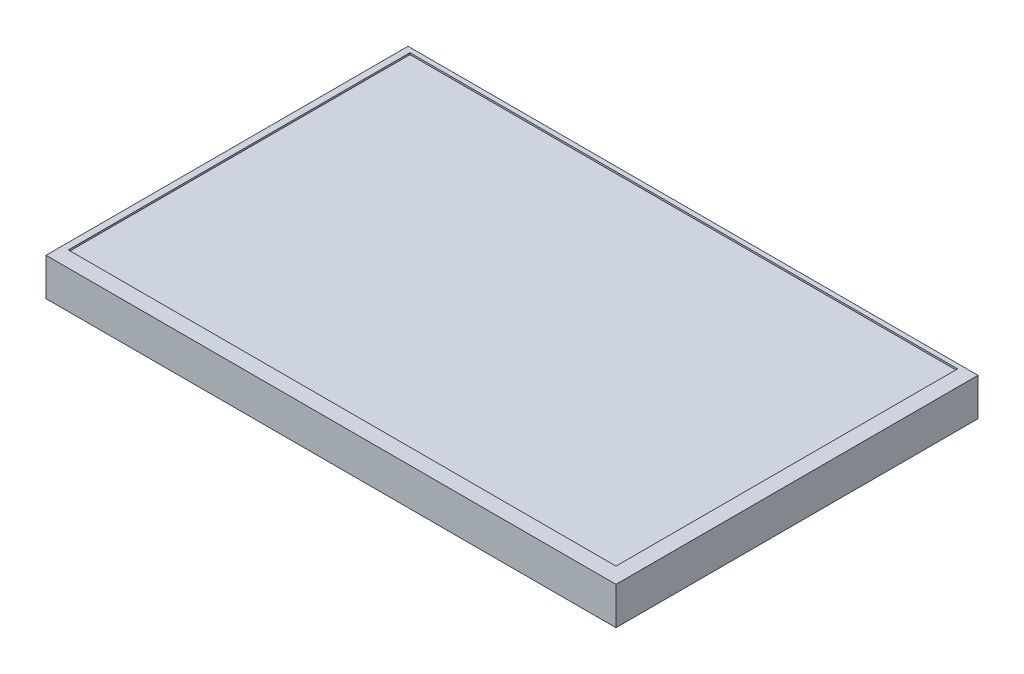
ISO-10303-21;
HEADER;
FILE_DESCRIPTION(('STEP AP214'),'2;1');
FILE_NAME('part.step','',(''),(''),'','','');
FILE_SCHEMA(('AUTOMOTIVE_DESIGN { 1 0 10303 214 1 1 1 1 }'));
ENDSEC;
DATA;
#1=APPLICATION_CONTEXT('core data for automotive mechanical design processes');
#2=APPLICATION_PROTOCOL_DEFINITION('international standard','automotive_design',2000,#1);
#3=PRODUCT_CONTEXT('',#1,'mechanical');
#4=PRODUCT('Part','Part','',(#3));
#5=PRODUCT_RELATED_PRODUCT_CATEGORY('part','',(#4));
#6=PRODUCT_DEFINITION_FORMATION('','',#4);
#7=PRODUCT_DEFINITION_CONTEXT('part definition',#1,'design');
#8=PRODUCT_DEFINITION('design','',#6,#7);
#9=PRODUCT_DEFINITION_SHAPE('','',#8);
#10=(LENGTH_UNIT() NAMED_UNIT(*) SI_UNIT(.MILLI.,.METRE.));
#11=(NAMED_UNIT(*) PLANE_ANGLE_UNIT() SI_UNIT($,.RADIAN.));
#12=(NAMED_UNIT(*) SI_UNIT($,.STERADIAN.) SOLID_ANGLE_UNIT());
#13=UNCERTAINTY_MEASURE_WITH_UNIT(LENGTH_MEASURE(1.E-05),#10,'distance_accuracy_value','');
#14=(GEOMETRIC_REPRESENTATION_CONTEXT(3) GLOBAL_UNCERTAINTY_ASSIGNED_CONTEXT((#13)) GLOBAL_UNIT_ASSIGNED_CONTEXT((#10,
#11,#12)) REPRESENTATION_CONTEXT('',''));
#15=CARTESIAN_POINT('',(0.,0.,0.));
#16=DIRECTION('',(0.,0.,1.));
#17=DIRECTION('',(1.,0.,0.));
#18=AXIS2_PLACEMENT_3D('',#15,#16,#17);
#19=CARTESIAN_POINT('',(83.,10.95,-52.72));
#20=DIRECTION('',(-1.,0.,0.));
#21=DIRECTION('',(0.,0.,1.));
#22=AXIS2_PLACEMENT_3D('',#19,#20,#21);
#23=PLANE('',#22);
#24=DIRECTION('',(0.,0.,-1.));
#25=VECTOR('',#24,1.);
#26=CARTESIAN_POINT('',(83.,0.,-52.72));
#27=LINE('',#26,#25);
#28=CARTESIAN_POINT('',(83.,0.,52.72));
#29=VERTEX_POINT('',#28);
#30=CARTESIAN_POINT('',(83.,0.,-52.72));
#31=VERTEX_POINT('',#30);
#32=EDGE_CURVE('E142',#29,#31,#27,.T.);
#33=ORIENTED_EDGE('',*,*,#32,.T.);
#34=DIRECTION('',(0.,-1.,0.));
#35=VECTOR('',#34,1.);
#36=CARTESIAN_POINT('',(83.,10.95,-52.72));
#37=LINE('',#36,#35);
#38=CARTESIAN_POINT('',(83.,10.95,-52.72));
#39=VERTEX_POINT('',#38);
#40=EDGE_CURVE('E11',#39,#31,#37,.T.);
#41=ORIENTED_EDGE('',*,*,#40,.F.);
#42=DIRECTION('',(0.,0.,-1.));
#43=VECTOR('',#42,1.);
#44=CARTESIAN_POINT('',(83.,10.95,-52.72));
#45=LINE('',#44,#43);
#46=CARTESIAN_POINT('',(83.,10.95,52.72));
#47=VERTEX_POINT('',#46);
#48=EDGE_CURVE('E146',#47,#39,#45,.T.);
#49=ORIENTED_EDGE('',*,*,#48,.F.);
#50=DIRECTION('',(0.,-1.,0.));
#51=VECTOR('',#50,1.);
#52=CARTESIAN_POINT('',(83.,10.95,52.72));
#53=LINE('',#52,#51);
#54=EDGE_CURVE('E152',#47,#29,#53,.T.);
#55=ORIENTED_EDGE('',*,*,#54,.T.);
#56=EDGE_LOOP('',(#33,#41,#49,#55));
#57=FACE_BOUND('',#56,.T.);
#58=ADVANCED_FACE('F34',(#57),#23,.F.);
#59=CARTESIAN_POINT('',(-83.,10.95,-52.72));
#60=DIRECTION('',(0.,0.,1.));
#61=DIRECTION('',(1.,0.,0.));
#62=AXIS2_PLACEMENT_3D('',#59,#60,#61);
#63=PLANE('',#62);
#64=DIRECTION('',(-1.,0.,0.));
#65=VECTOR('',#64,1.);
#66=CARTESIAN_POINT('',(-83.,0.,-52.72));
#67=LINE('',#66,#65);
#68=CARTESIAN_POINT('',(-83.,0.,-52.72));
#69=VERTEX_POINT('',#68);
#70=EDGE_CURVE('E155',#31,#69,#67,.T.);
#71=ORIENTED_EDGE('',*,*,#70,.T.);
#72=DIRECTION('',(0.,-1.,0.));
#73=VECTOR('',#72,1.);
#74=CARTESIAN_POINT('',(-83.,10.95,-52.72));
#75=LINE('',#74,#73);
#76=CARTESIAN_POINT('',(-83.,10.95,-52.72));
#77=VERTEX_POINT('',#76);
#78=EDGE_CURVE('E41',#77,#69,#75,.T.);
#79=ORIENTED_EDGE('',*,*,#78,.F.);
#80=DIRECTION('',(-1.,0.,0.));
#81=VECTOR('',#80,1.);
#82=CARTESIAN_POINT('',(-83.,10.95,-52.72));
#83=LINE('',#82,#81);
#84=EDGE_CURVE('E85',#39,#77,#83,.T.);
#85=ORIENTED_EDGE('',*,*,#84,.F.);
#86=ORIENTED_EDGE('',*,*,#40,.T.);
#87=EDGE_LOOP('',(#71,#79,#85,#86));
#88=FACE_BOUND('',#87,.T.);
#89=ADVANCED_FACE('F184',(#88),#63,.F.);
#90=CARTESIAN_POINT('',(-83.,10.95,-52.72));
#91=DIRECTION('',(1.,0.,0.));
#92=DIRECTION('',(0.,0.,-1.));
#93=AXIS2_PLACEMENT_3D('',#90,#91,#92);
#94=PLANE('',#93);
#95=DIRECTION('',(0.,0.,1.));
#96=VECTOR('',#95,1.);
#97=CARTESIAN_POINT('',(-83.,0.,-52.72));
#98=LINE('',#97,#96);
#99=CARTESIAN_POINT('',(-83.,0.,52.72));
#100=VERTEX_POINT('',#99);
#101=EDGE_CURVE('E157',#69,#100,#98,.T.);
#102=ORIENTED_EDGE('',*,*,#101,.T.);
#103=DIRECTION('',(0.,-1.,0.));
#104=VECTOR('',#103,1.);
#105=CARTESIAN_POINT('',(-83.,10.95,52.72));
#106=LINE('',#105,#104);
#107=CARTESIAN_POINT('',(-83.,10.95,52.72));
#108=VERTEX_POINT('',#107);
#109=EDGE_CURVE('E161',#108,#100,#106,.T.);
#110=ORIENTED_EDGE('',*,*,#109,.F.);
#111=DIRECTION('',(0.,0.,1.));
#112=VECTOR('',#111,1.);
#113=CARTESIAN_POINT('',(-83.,10.95,-52.72));
#114=LINE('',#113,#112);
#115=EDGE_CURVE('E149',#77,#108,#114,.T.);
#116=ORIENTED_EDGE('',*,*,#115,.F.);
#117=ORIENTED_EDGE('',*,*,#78,.T.);
#118=EDGE_LOOP('',(#102,#110,#116,#117));
#119=FACE_BOUND('',#118,.T.);
#120=ADVANCED_FACE('F166',(#119),#94,.F.);
#121=CARTESIAN_POINT('',(-83.,10.95,52.72));
#122=DIRECTION('',(0.,0.,-1.));
#123=DIRECTION('',(-1.,0.,0.));
#124=AXIS2_PLACEMENT_3D('',#121,#122,#123);
#125=PLANE('',#124);
#126=DIRECTION('',(1.,0.,0.));
#127=VECTOR('',#126,1.);
#128=CARTESIAN_POINT('',(-83.,0.,52.72));
#129=LINE('',#128,#127);
#130=EDGE_CURVE('E78',#100,#29,#129,.T.);
#131=ORIENTED_EDGE('',*,*,#130,.T.);
#132=ORIENTED_EDGE('',*,*,#54,.F.);
#133=DIRECTION('',(1.,0.,0.));
#134=VECTOR('',#133,1.);
#135=CARTESIAN_POINT('',(-83.,10.95,52.72));
#136=LINE('',#135,#134);
#137=EDGE_CURVE('E57',#108,#47,#136,.T.);
#138=ORIENTED_EDGE('',*,*,#137,.F.);
#139=ORIENTED_EDGE('',*,*,#109,.T.);
#140=EDGE_LOOP('',(#131,#132,#138,#139));
#141=FACE_BOUND('',#140,.T.);
#142=ADVANCED_FACE('F174',(#141),#125,.F.);
#143=CARTESIAN_POINT('',(0.,10.95,0.));
#144=DIRECTION('',(0.,1.,0.));
#145=DIRECTION('',(0.,0.,1.));
#146=AXIS2_PLACEMENT_3D('',#143,#144,#145);
#147=PLANE('',#146);
#148=DIRECTION('',(0.,0.,1.));
#149=VECTOR('',#148,1.);
#150=CARTESIAN_POINT('',(-81.1,10.95,-51.37));
#151=LINE('',#150,#149);
#152=CARTESIAN_POINT('',(-81.1,10.95,-51.37));
#153=VERTEX_POINT('',#152);
#154=CARTESIAN_POINT('',(-81.1,10.95,48.12));
#155=VERTEX_POINT('',#154);
#156=EDGE_CURVE('E48',#153,#155,#151,.T.);
#157=ORIENTED_EDGE('',*,*,#156,.F.);
#158=DIRECTION('',(-1.,0.,0.));
#159=VECTOR('',#158,1.);
#160=CARTESIAN_POINT('',(-81.1,10.95,-51.37));
#161=LINE('',#160,#159);
#162=CARTESIAN_POINT('',(78.4,10.95,-51.37));
#163=VERTEX_POINT('',#162);
#164=EDGE_CURVE('E127',#163,#153,#161,.T.);
#165=ORIENTED_EDGE('',*,*,#164,.F.);
#166=DIRECTION('',(0.,0.,-1.));
#167=VECTOR('',#166,1.);
#168=CARTESIAN_POINT('',(78.4,10.95,-51.37));
#169=LINE('',#168,#167);
#170=CARTESIAN_POINT('',(78.4,10.95,48.12));
#171=VERTEX_POINT('',#170);
#172=EDGE_CURVE('E130',#171,#163,#169,.T.);
#173=ORIENTED_EDGE('',*,*,#172,.F.);
#174=DIRECTION('',(1.,0.,0.));
#175=VECTOR('',#174,1.);
#176=CARTESIAN_POINT('',(-81.1,10.95,48.12));
#177=LINE('',#176,#175);
#178=EDGE_CURVE('E136',#155,#171,#177,.T.);
#179=ORIENTED_EDGE('',*,*,#178,.F.);
#180=EDGE_LOOP('',(#157,#165,#173,#179));
#181=FACE_BOUND('',#180,.T.);
#182=ORIENTED_EDGE('',*,*,#48,.T.);
#183=ORIENTED_EDGE('',*,*,#84,.T.);
#184=ORIENTED_EDGE('',*,*,#115,.T.);
#185=ORIENTED_EDGE('',*,*,#137,.T.);
#186=EDGE_LOOP('',(#182,#183,#184,#185));
#187=FACE_BOUND('',#186,.T.);
#188=ADVANCED_FACE('F176',(#181,#187),#147,.T.);
#189=CARTESIAN_POINT('',(0.,0.,0.));
#190=DIRECTION('',(0.,1.,0.));
#191=DIRECTION('',(0.,0.,1.));
#192=AXIS2_PLACEMENT_3D('',#189,#190,#191);
#193=PLANE('',#192);
#194=ORIENTED_EDGE('',*,*,#32,.F.);
#195=ORIENTED_EDGE('',*,*,#130,.F.);
#196=ORIENTED_EDGE('',*,*,#101,.F.);
#197=ORIENTED_EDGE('',*,*,#70,.F.);
#198=EDGE_LOOP('',(#194,#195,#196,#197));
#199=FACE_BOUND('',#198,.T.);
#200=ADVANCED_FACE('F170',(#199),#193,.F.);
#201=CARTESIAN_POINT('',(-81.1,10.45,-51.37));
#202=DIRECTION('',(-1.,0.,0.));
#203=DIRECTION('',(0.,0.,1.));
#204=AXIS2_PLACEMENT_3D('',#201,#202,#203);
#205=PLANE('',#204);
#206=ORIENTED_EDGE('',*,*,#156,.T.);
#207=DIRECTION('',(0.,1.,0.));
#208=VECTOR('',#207,1.);
#209=CARTESIAN_POINT('',(-81.1,10.45,48.12));
#210=LINE('',#209,#208);
#211=CARTESIAN_POINT('',(-81.1,10.45,48.12));
#212=VERTEX_POINT('',#211);
#213=EDGE_CURVE('E105',#212,#155,#210,.T.);
#214=ORIENTED_EDGE('',*,*,#213,.F.);
#215=DIRECTION('',(0.,0.,1.));
#216=VECTOR('',#215,1.);
#217=CARTESIAN_POINT('',(-81.1,10.45,-51.37));
#218=LINE('',#217,#216);
#219=CARTESIAN_POINT('',(-81.1,10.45,-51.37));
#220=VERTEX_POINT('',#219);
#221=EDGE_CURVE('E109',#220,#212,#218,.T.);
#222=ORIENTED_EDGE('',*,*,#221,.F.);
#223=DIRECTION('',(0.,1.,0.));
#224=VECTOR('',#223,1.);
#225=CARTESIAN_POINT('',(-81.1,10.45,-51.37));
#226=LINE('',#225,#224);
#227=EDGE_CURVE('E140',#220,#153,#226,.T.);
#228=ORIENTED_EDGE('',*,*,#227,.T.);
#229=EDGE_LOOP('',(#206,#214,#222,#228));
#230=FACE_BOUND('',#229,.T.);
#231=ADVANCED_FACE('F107',(#230),#205,.F.);
#232=CARTESIAN_POINT('',(-81.1,10.45,-51.37));
#233=DIRECTION('',(0.,0.,-1.));
#234=DIRECTION('',(-1.,0.,0.));
#235=AXIS2_PLACEMENT_3D('',#232,#233,#234);
#236=PLANE('',#235);
#237=ORIENTED_EDGE('',*,*,#164,.T.);
#238=ORIENTED_EDGE('',*,*,#227,.F.);
#239=DIRECTION('',(-1.,0.,0.));
#240=VECTOR('',#239,1.);
#241=CARTESIAN_POINT('',(-81.1,10.45,-51.37));
#242=LINE('',#241,#240);
#243=CARTESIAN_POINT('',(78.4,10.45,-51.37));
#244=VERTEX_POINT('',#243);
#245=EDGE_CURVE('E115',#244,#220,#242,.T.);
#246=ORIENTED_EDGE('',*,*,#245,.F.);
#247=DIRECTION('',(0.,1.,0.));
#248=VECTOR('',#247,1.);
#249=CARTESIAN_POINT('',(78.4,10.45,-51.37));
#250=LINE('',#249,#248);
#251=EDGE_CURVE('E143',#244,#163,#250,.T.);
#252=ORIENTED_EDGE('',*,*,#251,.T.);
#253=EDGE_LOOP('',(#237,#238,#246,#252));
#254=FACE_BOUND('',#253,.T.);
#255=ADVANCED_FACE('F238',(#254),#236,.F.);
#256=CARTESIAN_POINT('',(78.4,10.45,-51.37));
#257=DIRECTION('',(1.,0.,0.));
#258=DIRECTION('',(0.,0.,-1.));
#259=AXIS2_PLACEMENT_3D('',#256,#257,#258);
#260=PLANE('',#259);
#261=ORIENTED_EDGE('',*,*,#172,.T.);
#262=ORIENTED_EDGE('',*,*,#251,.F.);
#263=DIRECTION('',(0.,0.,-1.));
#264=VECTOR('',#263,1.);
#265=CARTESIAN_POINT('',(78.4,10.45,-51.37));
#266=LINE('',#265,#264);
#267=CARTESIAN_POINT('',(78.4,10.45,48.12));
#268=VERTEX_POINT('',#267);
#269=EDGE_CURVE('E123',#268,#244,#266,.T.);
#270=ORIENTED_EDGE('',*,*,#269,.F.);
#271=DIRECTION('',(0.,1.,0.));
#272=VECTOR('',#271,1.);
#273=CARTESIAN_POINT('',(78.4,10.45,48.12));
#274=LINE('',#273,#272);
#275=EDGE_CURVE('E114',#268,#171,#274,.T.);
#276=ORIENTED_EDGE('',*,*,#275,.T.);
#277=EDGE_LOOP('',(#261,#262,#270,#276));
#278=FACE_BOUND('',#277,.T.);
#279=ADVANCED_FACE('F231',(#278),#260,.F.);
#280=CARTESIAN_POINT('',(-81.1,10.45,48.12));
#281=DIRECTION('',(0.,0.,1.));
#282=DIRECTION('',(1.,0.,0.));
#283=AXIS2_PLACEMENT_3D('',#280,#281,#282);
#284=PLANE('',#283);
#285=ORIENTED_EDGE('',*,*,#178,.T.);
#286=ORIENTED_EDGE('',*,*,#275,.F.);
#287=DIRECTION('',(1.,0.,0.));
#288=VECTOR('',#287,1.);
#289=CARTESIAN_POINT('',(-81.1,10.45,48.12));
#290=LINE('',#289,#288);
#291=EDGE_CURVE('E118',#212,#268,#290,.T.);
#292=ORIENTED_EDGE('',*,*,#291,.F.);
#293=ORIENTED_EDGE('',*,*,#213,.T.);
#294=EDGE_LOOP('',(#285,#286,#292,#293));
#295=FACE_BOUND('',#294,.T.);
#296=ADVANCED_FACE('F119',(#295),#284,.F.);
#297=CARTESIAN_POINT('',(0.,10.45,0.));
#298=DIRECTION('',(0.,1.,0.));
#299=DIRECTION('',(0.,0.,1.));
#300=AXIS2_PLACEMENT_3D('',#297,#298,#299);
#301=PLANE('',#300);
#302=ORIENTED_EDGE('',*,*,#221,.T.);
#303=ORIENTED_EDGE('',*,*,#291,.T.);
#304=ORIENTED_EDGE('',*,*,#269,.T.);
#305=ORIENTED_EDGE('',*,*,#245,.T.);
#306=EDGE_LOOP('',(#302,#303,#304,#305));
#307=FACE_BOUND('',#306,.T.);
#308=ADVANCED_FACE('F125',(#307),#301,.T.);
#309=CLOSED_SHELL('',(#58,#89,#120,#142,#188,#200,#231,#255,#279,#296,#308));
#310=MANIFOLD_SOLID_BREP('B2',#309);
#311=ADVANCED_BREP_SHAPE_REPRESENTATION('',(#18,#310),#14);
#312=SHAPE_DEFINITION_REPRESENTATION(#9,#311);
ENDSEC;
END-ISO-10303-21;
